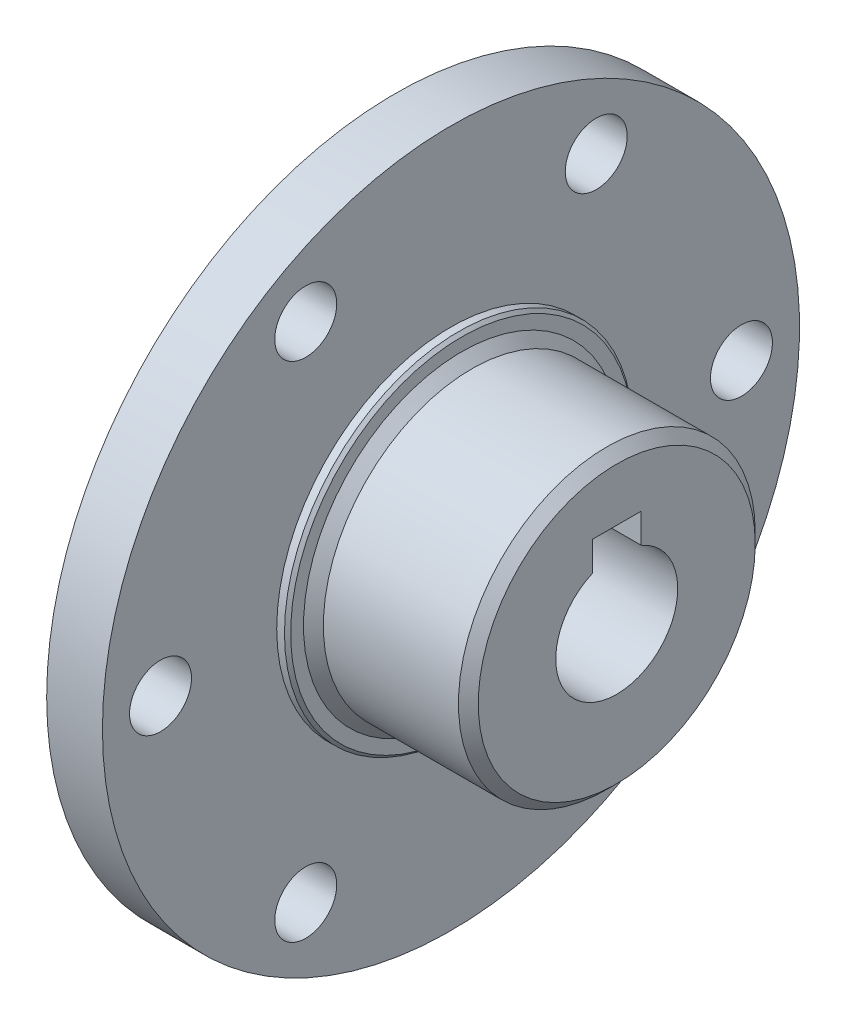
ISO-10303-21;
HEADER;
FILE_DESCRIPTION(('STEP AP214'),'2;1');
FILE_NAME('part.step','',(''),(''),'','','');
FILE_SCHEMA(('AUTOMOTIVE_DESIGN { 1 0 10303 214 1 1 1 1 }'));
ENDSEC;
DATA;
#1=APPLICATION_CONTEXT('core data for automotive mechanical design processes');
#2=APPLICATION_PROTOCOL_DEFINITION('international standard','automotive_design',2000,#1);
#3=PRODUCT_CONTEXT('',#1,'mechanical');
#4=PRODUCT('Part','Part','',(#3));
#5=PRODUCT_RELATED_PRODUCT_CATEGORY('part','',(#4));
#6=PRODUCT_DEFINITION_FORMATION('','',#4);
#7=PRODUCT_DEFINITION_CONTEXT('part definition',#1,'design');
#8=PRODUCT_DEFINITION('design','',#6,#7);
#9=PRODUCT_DEFINITION_SHAPE('','',#8);
#10=(LENGTH_UNIT() NAMED_UNIT(*) SI_UNIT(.MILLI.,.METRE.));
#11=(NAMED_UNIT(*) PLANE_ANGLE_UNIT() SI_UNIT($,.RADIAN.));
#12=(NAMED_UNIT(*) SI_UNIT($,.STERADIAN.) SOLID_ANGLE_UNIT());
#13=UNCERTAINTY_MEASURE_WITH_UNIT(LENGTH_MEASURE(1.E-05),#10,'distance_accuracy_value','');
#14=(GEOMETRIC_REPRESENTATION_CONTEXT(3) GLOBAL_UNCERTAINTY_ASSIGNED_CONTEXT((#13)) GLOBAL_UNIT_ASSIGNED_CONTEXT((#10,
#11,#12)) REPRESENTATION_CONTEXT('',''));
#15=CARTESIAN_POINT('',(0.,0.,0.));
#16=DIRECTION('',(0.,0.,1.));
#17=DIRECTION('',(1.,0.,0.));
#18=AXIS2_PLACEMENT_3D('',#15,#16,#17);
#19=CARTESIAN_POINT('',(-13.0350662460568,0.,0.));
#20=DIRECTION('',(-1.,0.,0.));
#21=DIRECTION('',(0.,0.,1.));
#22=AXIS2_PLACEMENT_3D('',#19,#20,#21);
#23=CYLINDRICAL_SURFACE('',#22,28.575);
#24=CARTESIAN_POINT('',(-13.0350662460568,0.,0.));
#25=DIRECTION('',(-1.,0.,0.));
#26=DIRECTION('',(0.,0.,1.));
#27=AXIS2_PLACEMENT_3D('',#24,#25,#26);
#28=CIRCLE('',#27,28.575);
#29=CARTESIAN_POINT('',(-13.0350662460568,0.,28.575));
#30=VERTEX_POINT('',#29);
#31=EDGE_CURVE('E115',#30,#30,#28,.T.);
#32=ORIENTED_EDGE('',*,*,#31,.T.);
#33=EDGE_LOOP('',(#32));
#34=FACE_BOUND('',#33,.T.);
#35=CARTESIAN_POINT('',(-17.6070662460568,0.,0.));
#36=DIRECTION('',(-1.,0.,0.));
#37=DIRECTION('',(0.,0.,1.));
#38=AXIS2_PLACEMENT_3D('',#35,#36,#37);
#39=CIRCLE('',#38,28.575);
#40=CARTESIAN_POINT('',(-17.6070662460568,0.,28.575));
#41=VERTEX_POINT('',#40);
#42=EDGE_CURVE('E79',#41,#41,#39,.T.);
#43=ORIENTED_EDGE('',*,*,#42,.F.);
#44=EDGE_LOOP('',(#43));
#45=FACE_BOUND('',#44,.T.);
#46=ADVANCED_FACE('F32',(#34,#45),#23,.T.);
#47=CARTESIAN_POINT('',(-13.0350662460568,28.575,0.));
#48=DIRECTION('',(1.,0.,0.));
#49=DIRECTION('',(0.,0.,-1.));
#50=AXIS2_PLACEMENT_3D('',#47,#48,#49);
#51=PLANE('',#50);
#52=CARTESIAN_POINT('',(-13.0350662460568,20.6222299276169,11.90625));
#53=DIRECTION('',(1.,0.,0.));
#54=DIRECTION('',(0.,0.,-1.));
#55=AXIS2_PLACEMENT_3D('',#52,#53,#54);
#56=CIRCLE('',#55,2.54);
#57=CARTESIAN_POINT('',(-13.0350662460568,20.6222299276169,9.36625));
#58=VERTEX_POINT('',#57);
#59=EDGE_CURVE('E200',#58,#58,#56,.T.);
#60=ORIENTED_EDGE('',*,*,#59,.F.);
#61=EDGE_LOOP('',(#60));
#62=FACE_BOUND('',#61,.T.);
#63=CARTESIAN_POINT('',(-13.0350662460568,20.6222299276169,-11.90625));
#64=DIRECTION('',(1.,0.,0.));
#65=DIRECTION('',(0.,0.,-1.));
#66=AXIS2_PLACEMENT_3D('',#63,#64,#65);
#67=CIRCLE('',#66,2.54);
#68=CARTESIAN_POINT('',(-13.0350662460568,20.6222299276169,-14.44625));
#69=VERTEX_POINT('',#68);
#70=EDGE_CURVE('E194',#69,#69,#67,.T.);
#71=ORIENTED_EDGE('',*,*,#70,.F.);
#72=EDGE_LOOP('',(#71));
#73=FACE_BOUND('',#72,.T.);
#74=CARTESIAN_POINT('',(-13.0350662460568,0.,-23.8125));
#75=DIRECTION('',(1.,0.,0.));
#76=DIRECTION('',(0.,0.,-1.));
#77=AXIS2_PLACEMENT_3D('',#74,#75,#76);
#78=CIRCLE('',#77,2.54);
#79=CARTESIAN_POINT('',(-13.0350662460568,0.,-26.3525));
#80=VERTEX_POINT('',#79);
#81=EDGE_CURVE('E188',#80,#80,#78,.T.);
#82=ORIENTED_EDGE('',*,*,#81,.F.);
#83=EDGE_LOOP('',(#82));
#84=FACE_BOUND('',#83,.T.);
#85=CARTESIAN_POINT('',(-13.0350662460568,-20.6222299276169,-11.90625));
#86=DIRECTION('',(1.,0.,0.));
#87=DIRECTION('',(0.,0.,-1.));
#88=AXIS2_PLACEMENT_3D('',#85,#86,#87);
#89=CIRCLE('',#88,2.54);
#90=CARTESIAN_POINT('',(-13.0350662460568,-20.6222299276169,-14.44625));
#91=VERTEX_POINT('',#90);
#92=EDGE_CURVE('E182',#91,#91,#89,.T.);
#93=ORIENTED_EDGE('',*,*,#92,.F.);
#94=EDGE_LOOP('',(#93));
#95=FACE_BOUND('',#94,.T.);
#96=CARTESIAN_POINT('',(-13.0350662460568,-20.622229927617,11.90625));
#97=DIRECTION('',(1.,0.,0.));
#98=DIRECTION('',(0.,0.,-1.));
#99=AXIS2_PLACEMENT_3D('',#96,#97,#98);
#100=CIRCLE('',#99,2.54);
#101=CARTESIAN_POINT('',(-13.0350662460568,-20.622229927617,9.36624999999995));
#102=VERTEX_POINT('',#101);
#103=EDGE_CURVE('E176',#102,#102,#100,.T.);
#104=ORIENTED_EDGE('',*,*,#103,.F.);
#105=EDGE_LOOP('',(#104));
#106=FACE_BOUND('',#105,.T.);
#107=CARTESIAN_POINT('',(-13.0350662460568,0.,23.8125));
#108=DIRECTION('',(1.,0.,0.));
#109=DIRECTION('',(0.,0.,-1.));
#110=AXIS2_PLACEMENT_3D('',#107,#108,#109);
#111=CIRCLE('',#110,2.54);
#112=CARTESIAN_POINT('',(-13.0350662460568,0.,21.2725));
#113=VERTEX_POINT('',#112);
#114=EDGE_CURVE('E90',#113,#113,#111,.T.);
#115=ORIENTED_EDGE('',*,*,#114,.F.);
#116=EDGE_LOOP('',(#115));
#117=FACE_BOUND('',#116,.T.);
#118=CARTESIAN_POINT('',(-13.0350662460568,0.,0.));
#119=DIRECTION('',(1.,0.,0.));
#120=DIRECTION('',(0.,0.,-1.));
#121=AXIS2_PLACEMENT_3D('',#118,#119,#120);
#122=CIRCLE('',#121,14.2875);
#123=CARTESIAN_POINT('',(-13.0350662460568,0.,-14.2875));
#124=VERTEX_POINT('',#123);
#125=EDGE_CURVE('E112',#124,#124,#122,.T.);
#126=ORIENTED_EDGE('',*,*,#125,.F.);
#127=EDGE_LOOP('',(#126));
#128=FACE_BOUND('',#127,.T.);
#129=ORIENTED_EDGE('',*,*,#31,.F.);
#130=EDGE_LOOP('',(#129));
#131=FACE_BOUND('',#130,.T.);
#132=ADVANCED_FACE('F213',(#62,#73,#84,#95,#106,#117,#128,#131),#51,.T.);
#133=CARTESIAN_POINT('',(-17.6070662460568,0.,0.));
#134=DIRECTION('',(-1.,0.,0.));
#135=DIRECTION('',(0.,0.,1.));
#136=AXIS2_PLACEMENT_3D('',#133,#134,#135);
#137=PLANE('',#136);
#138=CARTESIAN_POINT('',(-17.6070662460568,20.6222299276169,11.90625));
#139=DIRECTION('',(-1.,0.,0.));
#140=DIRECTION('',(0.,0.,1.));
#141=AXIS2_PLACEMENT_3D('',#138,#139,#140);
#142=CIRCLE('',#141,2.54);
#143=CARTESIAN_POINT('',(-17.6070662460568,20.6222299276169,14.44625));
#144=VERTEX_POINT('',#143);
#145=EDGE_CURVE('E203',#144,#144,#142,.T.);
#146=ORIENTED_EDGE('',*,*,#145,.F.);
#147=EDGE_LOOP('',(#146));
#148=FACE_BOUND('',#147,.T.);
#149=CARTESIAN_POINT('',(-17.6070662460568,20.6222299276169,-11.90625));
#150=DIRECTION('',(-1.,0.,0.));
#151=DIRECTION('',(0.,0.,1.));
#152=AXIS2_PLACEMENT_3D('',#149,#150,#151);
#153=CIRCLE('',#152,2.54);
#154=CARTESIAN_POINT('',(-17.6070662460568,20.6222299276169,-9.36624999999998));
#155=VERTEX_POINT('',#154);
#156=EDGE_CURVE('E197',#155,#155,#153,.T.);
#157=ORIENTED_EDGE('',*,*,#156,.F.);
#158=EDGE_LOOP('',(#157));
#159=FACE_BOUND('',#158,.T.);
#160=CARTESIAN_POINT('',(-17.6070662460568,0.,-23.8125));
#161=DIRECTION('',(-1.,0.,0.));
#162=DIRECTION('',(0.,0.,1.));
#163=AXIS2_PLACEMENT_3D('',#160,#161,#162);
#164=CIRCLE('',#163,2.54);
#165=CARTESIAN_POINT('',(-17.6070662460568,0.,-21.2725));
#166=VERTEX_POINT('',#165);
#167=EDGE_CURVE('E191',#166,#166,#164,.T.);
#168=ORIENTED_EDGE('',*,*,#167,.F.);
#169=EDGE_LOOP('',(#168));
#170=FACE_BOUND('',#169,.T.);
#171=CARTESIAN_POINT('',(-17.6070662460568,-20.6222299276169,-11.90625));
#172=DIRECTION('',(-1.,0.,0.));
#173=DIRECTION('',(0.,0.,1.));
#174=AXIS2_PLACEMENT_3D('',#171,#172,#173);
#175=CIRCLE('',#174,2.54);
#176=CARTESIAN_POINT('',(-17.6070662460568,-20.6222299276169,-9.36625000000004));
#177=VERTEX_POINT('',#176);
#178=EDGE_CURVE('E185',#177,#177,#175,.T.);
#179=ORIENTED_EDGE('',*,*,#178,.F.);
#180=EDGE_LOOP('',(#179));
#181=FACE_BOUND('',#180,.T.);
#182=CARTESIAN_POINT('',(-17.6070662460568,-20.622229927617,11.90625));
#183=DIRECTION('',(-1.,0.,0.));
#184=DIRECTION('',(0.,0.,1.));
#185=AXIS2_PLACEMENT_3D('',#182,#183,#184);
#186=CIRCLE('',#185,2.54);
#187=CARTESIAN_POINT('',(-17.6070662460568,-20.622229927617,14.44625));
#188=VERTEX_POINT('',#187);
#189=EDGE_CURVE('E179',#188,#188,#186,.T.);
#190=ORIENTED_EDGE('',*,*,#189,.F.);
#191=EDGE_LOOP('',(#190));
#192=FACE_BOUND('',#191,.T.);
#193=CARTESIAN_POINT('',(-17.6070662460568,0.,23.8125));
#194=DIRECTION('',(-1.,0.,0.));
#195=DIRECTION('',(0.,0.,1.));
#196=AXIS2_PLACEMENT_3D('',#193,#194,#195);
#197=CIRCLE('',#196,2.54);
#198=CARTESIAN_POINT('',(-17.6070662460568,0.,26.3525));
#199=VERTEX_POINT('',#198);
#200=EDGE_CURVE('E122',#199,#199,#197,.T.);
#201=ORIENTED_EDGE('',*,*,#200,.F.);
#202=EDGE_LOOP('',(#201));
#203=FACE_BOUND('',#202,.T.);
#204=CARTESIAN_POINT('',(-17.6070662460568,0.,0.));
#205=DIRECTION('',(-1.,0.,0.));
#206=DIRECTION('',(0.,0.,1.));
#207=AXIS2_PLACEMENT_3D('',#204,#205,#206);
#208=CIRCLE('',#207,14.2875);
#209=CARTESIAN_POINT('',(-17.6070662460568,0.,14.2875));
#210=VERTEX_POINT('',#209);
#211=EDGE_CURVE('E108',#210,#210,#208,.T.);
#212=ORIENTED_EDGE('',*,*,#211,.F.);
#213=EDGE_LOOP('',(#212));
#214=FACE_BOUND('',#213,.T.);
#215=ORIENTED_EDGE('',*,*,#42,.T.);
#216=EDGE_LOOP('',(#215));
#217=FACE_BOUND('',#216,.T.);
#218=ADVANCED_FACE('F209',(#148,#159,#170,#181,#192,#203,#214,#217),#137,.T.);
#219=CARTESIAN_POINT('',(-12.1460662460568,0.,0.));
#220=DIRECTION('',(-1.,0.,0.));
#221=DIRECTION('',(0.,0.,1.));
#222=AXIS2_PLACEMENT_3D('',#219,#220,#221);
#223=CYLINDRICAL_SURFACE('',#222,14.2875);
#224=CARTESIAN_POINT('',(-12.4000662460568,0.,0.));
#225=DIRECTION('',(1.,0.,0.));
#226=DIRECTION('',(0.,0.,-1.));
#227=AXIS2_PLACEMENT_3D('',#224,#225,#226);
#228=CIRCLE('',#227,14.2875);
#229=CARTESIAN_POINT('',(-12.4000662460568,0.,-14.2875));
#230=VERTEX_POINT('',#229);
#231=EDGE_CURVE('E125',#230,#230,#228,.F.);
#232=ORIENTED_EDGE('',*,*,#231,.T.);
#233=EDGE_LOOP('',(#232));
#234=FACE_BOUND('',#233,.T.);
#235=ORIENTED_EDGE('',*,*,#125,.T.);
#236=EDGE_LOOP('',(#235));
#237=FACE_BOUND('',#236,.T.);
#238=ADVANCED_FACE('F212',(#234,#237),#223,.T.);
#239=CARTESIAN_POINT('',(-12.1460662460568,0.,0.));
#240=DIRECTION('',(1.,0.,0.));
#241=DIRECTION('',(0.,0.,-1.));
#242=AXIS2_PLACEMENT_3D('',#239,#240,#241);
#243=PLANE('',#242);
#244=CARTESIAN_POINT('',(-12.1460662460568,0.,0.));
#245=DIRECTION('',(1.,0.,0.));
#246=DIRECTION('',(0.,0.,-1.));
#247=AXIS2_PLACEMENT_3D('',#244,#245,#246);
#248=CIRCLE('',#247,12.9794);
#249=CARTESIAN_POINT('',(-12.1460662460568,0.,-12.9794));
#250=VERTEX_POINT('',#249);
#251=EDGE_CURVE('E40',#250,#250,#248,.F.);
#252=ORIENTED_EDGE('',*,*,#251,.T.);
#253=EDGE_LOOP('',(#252));
#254=FACE_BOUND('',#253,.T.);
#255=CARTESIAN_POINT('',(-12.1460662460568,0.,0.));
#256=DIRECTION('',(1.,0.,0.));
#257=DIRECTION('',(0.,0.,-1.));
#258=AXIS2_PLACEMENT_3D('',#255,#256,#257);
#259=CIRCLE('',#258,14.0335);
#260=CARTESIAN_POINT('',(-12.1460662460568,0.,-14.0335));
#261=VERTEX_POINT('',#260);
#262=EDGE_CURVE('E111',#261,#261,#259,.T.);
#263=ORIENTED_EDGE('',*,*,#262,.T.);
#264=EDGE_LOOP('',(#263));
#265=FACE_BOUND('',#264,.T.);
#266=ADVANCED_FACE('F142',(#254,#265),#243,.T.);
#267=CARTESIAN_POINT('',(0.553933753943227,0.,0.));
#268=DIRECTION('',(-1.,0.,0.));
#269=DIRECTION('',(0.,0.,1.));
#270=AXIS2_PLACEMENT_3D('',#267,#268,#269);
#271=CYLINDRICAL_SURFACE('',#270,12.1666);
#272=CARTESIAN_POINT('',(-11.3332662460568,0.,0.));
#273=DIRECTION('',(1.,0.,0.));
#274=DIRECTION('',(0.,0.,-1.));
#275=AXIS2_PLACEMENT_3D('',#272,#273,#274);
#276=CIRCLE('',#275,12.1666);
#277=CARTESIAN_POINT('',(-11.3332662460568,0.,-12.1666));
#278=VERTEX_POINT('',#277);
#279=EDGE_CURVE('E137',#278,#278,#276,.T.);
#280=ORIENTED_EDGE('',*,*,#279,.T.);
#281=EDGE_LOOP('',(#280));
#282=FACE_BOUND('',#281,.T.);
#283=CARTESIAN_POINT('',(-0.258866246056769,0.,0.));
#284=DIRECTION('',(1.,0.,0.));
#285=DIRECTION('',(0.,0.,-1.));
#286=AXIS2_PLACEMENT_3D('',#283,#284,#285);
#287=CIRCLE('',#286,12.1666);
#288=CARTESIAN_POINT('',(-0.258866246056769,0.,-12.1666));
#289=VERTEX_POINT('',#288);
#290=EDGE_CURVE('E134',#289,#289,#287,.F.);
#291=ORIENTED_EDGE('',*,*,#290,.T.);
#292=EDGE_LOOP('',(#291));
#293=FACE_BOUND('',#292,.T.);
#294=ADVANCED_FACE('F151',(#282,#293),#271,.T.);
#295=CARTESIAN_POINT('',(0.553933753943227,0.,0.));
#296=DIRECTION('',(1.,0.,0.));
#297=DIRECTION('',(0.,0.,-1.));
#298=AXIS2_PLACEMENT_3D('',#295,#296,#297);
#299=PLANE('',#298);
#300=CARTESIAN_POINT('',(0.553933753943227,0.,0.));
#301=DIRECTION('',(1.,0.,0.));
#302=DIRECTION('',(0.,0.,-1.));
#303=AXIS2_PLACEMENT_3D('',#300,#301,#302);
#304=CIRCLE('',#303,11.3538);
#305=CARTESIAN_POINT('',(0.553933753943227,0.,-11.3538));
#306=VERTEX_POINT('',#305);
#307=EDGE_CURVE('E11',#306,#306,#304,.T.);
#308=ORIENTED_EDGE('',*,*,#307,.T.);
#309=EDGE_LOOP('',(#308));
#310=FACE_BOUND('',#309,.T.);
#311=CARTESIAN_POINT('',(0.553933753943227,0.,0.));
#312=DIRECTION('',(-1.,0.,0.));
#313=DIRECTION('',(0.,0.,1.));
#314=AXIS2_PLACEMENT_3D('',#311,#312,#313);
#315=CIRCLE('',#314,5.);
#316=CARTESIAN_POINT('',(0.553933753943227,4.58257569495584,-2.));
#317=VERTEX_POINT('',#316);
#318=CARTESIAN_POINT('',(0.553933753943227,4.58257569495584,2.));
#319=VERTEX_POINT('',#318);
#320=EDGE_CURVE('E74',#317,#319,#315,.T.);
#321=ORIENTED_EDGE('',*,*,#320,.T.);
#322=DIRECTION('',(0.,1.,0.));
#323=VECTOR('',#322,1.);
#324=CARTESIAN_POINT('',(0.553933753943227,4.58257569495584,2.));
#325=LINE('',#324,#323);
#326=CARTESIAN_POINT('',(0.553933753943227,7.,2.));
#327=VERTEX_POINT('',#326);
#328=EDGE_CURVE('E94',#319,#327,#325,.T.);
#329=ORIENTED_EDGE('',*,*,#328,.T.);
#330=DIRECTION('',(0.,0.,-1.));
#331=VECTOR('',#330,1.);
#332=CARTESIAN_POINT('',(0.553933753943227,7.,2.));
#333=LINE('',#332,#331);
#334=CARTESIAN_POINT('',(0.553933753943227,7.,-2.));
#335=VERTEX_POINT('',#334);
#336=EDGE_CURVE('E47',#327,#335,#333,.T.);
#337=ORIENTED_EDGE('',*,*,#336,.T.);
#338=DIRECTION('',(0.,-1.,0.));
#339=VECTOR('',#338,1.);
#340=CARTESIAN_POINT('',(0.553933753943227,7.,-2.));
#341=LINE('',#340,#339);
#342=EDGE_CURVE('E107',#335,#317,#341,.T.);
#343=ORIENTED_EDGE('',*,*,#342,.T.);
#344=EDGE_LOOP('',(#321,#329,#337,#343));
#345=FACE_BOUND('',#344,.T.);
#346=ADVANCED_FACE('F154',(#310,#345),#299,.T.);
#347=CARTESIAN_POINT('',(-18.4960662460568,0.,0.));
#348=DIRECTION('',(1.,0.,0.));
#349=DIRECTION('',(0.,0.,-1.));
#350=AXIS2_PLACEMENT_3D('',#347,#348,#349);
#351=CYLINDRICAL_SURFACE('',#350,14.2875);
#352=CARTESIAN_POINT('',(-18.2420662460568,0.,0.));
#353=DIRECTION('',(-1.,0.,0.));
#354=DIRECTION('',(0.,0.,1.));
#355=AXIS2_PLACEMENT_3D('',#352,#353,#354);
#356=CIRCLE('',#355,14.2875);
#357=CARTESIAN_POINT('',(-18.2420662460568,0.,14.2875));
#358=VERTEX_POINT('',#357);
#359=EDGE_CURVE('E131',#358,#358,#356,.F.);
#360=ORIENTED_EDGE('',*,*,#359,.T.);
#361=EDGE_LOOP('',(#360));
#362=FACE_BOUND('',#361,.T.);
#363=ORIENTED_EDGE('',*,*,#211,.T.);
#364=EDGE_LOOP('',(#363));
#365=FACE_BOUND('',#364,.T.);
#366=ADVANCED_FACE('F164',(#362,#365),#351,.T.);
#367=CARTESIAN_POINT('',(-18.4960662460568,0.,0.));
#368=DIRECTION('',(-1.,0.,0.));
#369=DIRECTION('',(0.,0.,1.));
#370=AXIS2_PLACEMENT_3D('',#367,#368,#369);
#371=PLANE('',#370);
#372=CARTESIAN_POINT('',(-18.4960662460568,0.,0.));
#373=DIRECTION('',(-1.,0.,0.));
#374=DIRECTION('',(0.,0.,1.));
#375=AXIS2_PLACEMENT_3D('',#372,#373,#374);
#376=CIRCLE('',#375,14.0335);
#377=CARTESIAN_POINT('',(-18.4960662460568,0.,14.0335));
#378=VERTEX_POINT('',#377);
#379=EDGE_CURVE('E128',#378,#378,#376,.T.);
#380=ORIENTED_EDGE('',*,*,#379,.T.);
#381=EDGE_LOOP('',(#380));
#382=FACE_BOUND('',#381,.T.);
#383=CARTESIAN_POINT('',(-18.4960662460568,0.,0.));
#384=DIRECTION('',(-1.,0.,0.));
#385=DIRECTION('',(0.,0.,1.));
#386=AXIS2_PLACEMENT_3D('',#383,#384,#385);
#387=CIRCLE('',#386,5.);
#388=CARTESIAN_POINT('',(-18.4960662460568,4.58257569495584,-2.));
#389=VERTEX_POINT('',#388);
#390=CARTESIAN_POINT('',(-18.4960662460568,4.58257569495584,2.));
#391=VERTEX_POINT('',#390);
#392=EDGE_CURVE('E55',#389,#391,#387,.T.);
#393=ORIENTED_EDGE('',*,*,#392,.F.);
#394=DIRECTION('',(0.,-1.,0.));
#395=VECTOR('',#394,1.);
#396=CARTESIAN_POINT('',(-18.4960662460568,7.,-2.));
#397=LINE('',#396,#395);
#398=CARTESIAN_POINT('',(-18.4960662460568,7.,-2.));
#399=VERTEX_POINT('',#398);
#400=EDGE_CURVE('E87',#399,#389,#397,.T.);
#401=ORIENTED_EDGE('',*,*,#400,.F.);
#402=DIRECTION('',(0.,0.,-1.));
#403=VECTOR('',#402,1.);
#404=CARTESIAN_POINT('',(-18.4960662460568,7.,2.));
#405=LINE('',#404,#403);
#406=CARTESIAN_POINT('',(-18.4960662460568,7.,2.));
#407=VERTEX_POINT('',#406);
#408=EDGE_CURVE('E95',#407,#399,#405,.T.);
#409=ORIENTED_EDGE('',*,*,#408,.F.);
#410=DIRECTION('',(0.,1.,0.));
#411=VECTOR('',#410,1.);
#412=CARTESIAN_POINT('',(-18.4960662460568,4.58257569495584,2.));
#413=LINE('',#412,#411);
#414=EDGE_CURVE('E89',#391,#407,#413,.T.);
#415=ORIENTED_EDGE('',*,*,#414,.F.);
#416=EDGE_LOOP('',(#393,#401,#409,#415));
#417=FACE_BOUND('',#416,.T.);
#418=ADVANCED_FACE('F85',(#382,#417),#371,.T.);
#419=CARTESIAN_POINT('',(0.553933753943227,7.,-2.));
#420=DIRECTION('',(0.,0.,-1.));
#421=DIRECTION('',(0.,1.,0.));
#422=AXIS2_PLACEMENT_3D('',#419,#420,#421);
#423=PLANE('',#422);
#424=ORIENTED_EDGE('',*,*,#400,.T.);
#425=DIRECTION('',(-1.,0.,0.));
#426=VECTOR('',#425,1.);
#427=CARTESIAN_POINT('',(0.553933753943227,4.58257569495584,-2.));
#428=LINE('',#427,#426);
#429=EDGE_CURVE('E71',#317,#389,#428,.T.);
#430=ORIENTED_EDGE('',*,*,#429,.F.);
#431=ORIENTED_EDGE('',*,*,#342,.F.);
#432=DIRECTION('',(-1.,0.,0.));
#433=VECTOR('',#432,1.);
#434=CARTESIAN_POINT('',(0.553933753943227,7.,-2.));
#435=LINE('',#434,#433);
#436=EDGE_CURVE('E80',#335,#399,#435,.T.);
#437=ORIENTED_EDGE('',*,*,#436,.T.);
#438=EDGE_LOOP('',(#424,#430,#431,#437));
#439=FACE_BOUND('',#438,.T.);
#440=ADVANCED_FACE('F92',(#439),#423,.F.);
#441=CARTESIAN_POINT('',(0.553933753943227,7.,2.));
#442=DIRECTION('',(0.,1.,0.));
#443=DIRECTION('',(0.,0.,1.));
#444=AXIS2_PLACEMENT_3D('',#441,#442,#443);
#445=PLANE('',#444);
#446=ORIENTED_EDGE('',*,*,#408,.T.);
#447=ORIENTED_EDGE('',*,*,#436,.F.);
#448=ORIENTED_EDGE('',*,*,#336,.F.);
#449=DIRECTION('',(-1.,0.,0.));
#450=VECTOR('',#449,1.);
#451=CARTESIAN_POINT('',(0.553933753943227,7.,2.));
#452=LINE('',#451,#450);
#453=EDGE_CURVE('E103',#327,#407,#452,.T.);
#454=ORIENTED_EDGE('',*,*,#453,.T.);
#455=EDGE_LOOP('',(#446,#447,#448,#454));
#456=FACE_BOUND('',#455,.T.);
#457=ADVANCED_FACE('F170',(#456),#445,.F.);
#458=CARTESIAN_POINT('',(0.553933753943227,4.58257569495584,2.));
#459=DIRECTION('',(0.,0.,1.));
#460=DIRECTION('',(0.,-1.,0.));
#461=AXIS2_PLACEMENT_3D('',#458,#459,#460);
#462=PLANE('',#461);
#463=ORIENTED_EDGE('',*,*,#414,.T.);
#464=ORIENTED_EDGE('',*,*,#453,.F.);
#465=ORIENTED_EDGE('',*,*,#328,.F.);
#466=DIRECTION('',(-1.,0.,0.));
#467=VECTOR('',#466,1.);
#468=CARTESIAN_POINT('',(0.553933753943227,4.58257569495584,2.));
#469=LINE('',#468,#467);
#470=EDGE_CURVE('E105',#319,#391,#469,.T.);
#471=ORIENTED_EDGE('',*,*,#470,.T.);
#472=EDGE_LOOP('',(#463,#464,#465,#471));
#473=FACE_BOUND('',#472,.T.);
#474=ADVANCED_FACE('F169',(#473),#462,.F.);
#475=CARTESIAN_POINT('',(0.553933753943227,0.,0.));
#476=DIRECTION('',(-1.,0.,0.));
#477=DIRECTION('',(0.,0.,1.));
#478=AXIS2_PLACEMENT_3D('',#475,#476,#477);
#479=CYLINDRICAL_SURFACE('',#478,5.);
#480=ORIENTED_EDGE('',*,*,#392,.T.);
#481=ORIENTED_EDGE('',*,*,#470,.F.);
#482=ORIENTED_EDGE('',*,*,#320,.F.);
#483=ORIENTED_EDGE('',*,*,#429,.T.);
#484=EDGE_LOOP('',(#480,#481,#482,#483));
#485=FACE_BOUND('',#484,.T.);
#486=ADVANCED_FACE('F72',(#485),#479,.F.);
#487=CARTESIAN_POINT('',(-17.6070662460568,0.,23.8125));
#488=DIRECTION('',(-1.,0.,0.));
#489=DIRECTION('',(0.,0.,1.));
#490=AXIS2_PLACEMENT_3D('',#487,#488,#489);
#491=CYLINDRICAL_SURFACE('',#490,2.54);
#492=ORIENTED_EDGE('',*,*,#114,.T.);
#493=EDGE_LOOP('',(#492));
#494=FACE_BOUND('',#493,.T.);
#495=ORIENTED_EDGE('',*,*,#200,.T.);
#496=EDGE_LOOP('',(#495));
#497=FACE_BOUND('',#496,.T.);
#498=ADVANCED_FACE('F361',(#494,#497),#491,.F.);
#499=CARTESIAN_POINT('',(-17.6070662460568,-20.622229927617,11.90625));
#500=DIRECTION('',(-1.,0.,0.));
#501=DIRECTION('',(0.,0.,1.));
#502=AXIS2_PLACEMENT_3D('',#499,#500,#501);
#503=CYLINDRICAL_SURFACE('',#502,2.54);
#504=ORIENTED_EDGE('',*,*,#103,.T.);
#505=EDGE_LOOP('',(#504));
#506=FACE_BOUND('',#505,.T.);
#507=ORIENTED_EDGE('',*,*,#189,.T.);
#508=EDGE_LOOP('',(#507));
#509=FACE_BOUND('',#508,.T.);
#510=ADVANCED_FACE('F353',(#506,#509),#503,.F.);
#511=CARTESIAN_POINT('',(-17.6070662460568,-20.6222299276169,-11.90625));
#512=DIRECTION('',(-1.,0.,0.));
#513=DIRECTION('',(0.,0.,1.));
#514=AXIS2_PLACEMENT_3D('',#511,#512,#513);
#515=CYLINDRICAL_SURFACE('',#514,2.54);
#516=ORIENTED_EDGE('',*,*,#92,.T.);
#517=EDGE_LOOP('',(#516));
#518=FACE_BOUND('',#517,.T.);
#519=ORIENTED_EDGE('',*,*,#178,.T.);
#520=EDGE_LOOP('',(#519));
#521=FACE_BOUND('',#520,.T.);
#522=ADVANCED_FACE('F345',(#518,#521),#515,.F.);
#523=CARTESIAN_POINT('',(-17.6070662460568,0.,-23.8125));
#524=DIRECTION('',(-1.,0.,0.));
#525=DIRECTION('',(0.,0.,1.));
#526=AXIS2_PLACEMENT_3D('',#523,#524,#525);
#527=CYLINDRICAL_SURFACE('',#526,2.54);
#528=ORIENTED_EDGE('',*,*,#81,.T.);
#529=EDGE_LOOP('',(#528));
#530=FACE_BOUND('',#529,.T.);
#531=ORIENTED_EDGE('',*,*,#167,.T.);
#532=EDGE_LOOP('',(#531));
#533=FACE_BOUND('',#532,.T.);
#534=ADVANCED_FACE('F337',(#530,#533),#527,.F.);
#535=CARTESIAN_POINT('',(-17.6070662460568,20.6222299276169,-11.90625));
#536=DIRECTION('',(-1.,0.,0.));
#537=DIRECTION('',(0.,0.,1.));
#538=AXIS2_PLACEMENT_3D('',#535,#536,#537);
#539=CYLINDRICAL_SURFACE('',#538,2.54);
#540=ORIENTED_EDGE('',*,*,#70,.T.);
#541=EDGE_LOOP('',(#540));
#542=FACE_BOUND('',#541,.T.);
#543=ORIENTED_EDGE('',*,*,#156,.T.);
#544=EDGE_LOOP('',(#543));
#545=FACE_BOUND('',#544,.T.);
#546=ADVANCED_FACE('F330',(#542,#545),#539,.F.);
#547=CARTESIAN_POINT('',(-17.6070662460568,20.6222299276169,11.90625));
#548=DIRECTION('',(-1.,0.,0.));
#549=DIRECTION('',(0.,0.,1.));
#550=AXIS2_PLACEMENT_3D('',#547,#548,#549);
#551=CYLINDRICAL_SURFACE('',#550,2.54);
#552=ORIENTED_EDGE('',*,*,#59,.T.);
#553=EDGE_LOOP('',(#552));
#554=FACE_BOUND('',#553,.T.);
#555=ORIENTED_EDGE('',*,*,#145,.T.);
#556=EDGE_LOOP('',(#555));
#557=FACE_BOUND('',#556,.T.);
#558=ADVANCED_FACE('F207',(#554,#557),#551,.F.);
#559=CARTESIAN_POINT('',(-12.1460662460568,0.,0.));
#560=DIRECTION('',(-1.,0.,0.));
#561=DIRECTION('',(0.,0.,1.));
#562=AXIS2_PLACEMENT_3D('',#559,#560,#561);
#563=CONICAL_SURFACE('',#562,14.0335,0.785398163397452);
#564=ORIENTED_EDGE('',*,*,#231,.F.);
#565=EDGE_LOOP('',(#564));
#566=FACE_BOUND('',#565,.T.);
#567=ORIENTED_EDGE('',*,*,#262,.F.);
#568=EDGE_LOOP('',(#567));
#569=FACE_BOUND('',#568,.T.);
#570=ADVANCED_FACE('F238',(#566,#569),#563,.T.);
#571=CARTESIAN_POINT('',(-18.4960662460568,0.,0.));
#572=DIRECTION('',(1.,0.,0.));
#573=DIRECTION('',(0.,0.,-1.));
#574=AXIS2_PLACEMENT_3D('',#571,#572,#573);
#575=CONICAL_SURFACE('',#574,14.0335,0.785398163397448);
#576=ORIENTED_EDGE('',*,*,#359,.F.);
#577=EDGE_LOOP('',(#576));
#578=FACE_BOUND('',#577,.T.);
#579=ORIENTED_EDGE('',*,*,#379,.F.);
#580=EDGE_LOOP('',(#579));
#581=FACE_BOUND('',#580,.T.);
#582=ADVANCED_FACE('F148',(#578,#581),#575,.T.);
#583=CARTESIAN_POINT('',(-11.3332662460568,0.,0.));
#584=DIRECTION('',(-1.,0.,0.));
#585=DIRECTION('',(0.,0.,1.));
#586=AXIS2_PLACEMENT_3D('',#583,#584,#585);
#587=CONICAL_SURFACE('',#586,12.1666,0.785398163397437);
#588=ORIENTED_EDGE('',*,*,#251,.F.);
#589=EDGE_LOOP('',(#588));
#590=FACE_BOUND('',#589,.T.);
#591=ORIENTED_EDGE('',*,*,#279,.F.);
#592=EDGE_LOOP('',(#591));
#593=FACE_BOUND('',#592,.T.);
#594=ADVANCED_FACE('F145',(#590,#593),#587,.T.);
#595=CARTESIAN_POINT('',(0.553933753943227,0.,0.));
#596=DIRECTION('',(-1.,0.,0.));
#597=DIRECTION('',(0.,0.,1.));
#598=AXIS2_PLACEMENT_3D('',#595,#596,#597);
#599=CONICAL_SURFACE('',#598,11.3538,0.785398163397446);
#600=ORIENTED_EDGE('',*,*,#290,.F.);
#601=EDGE_LOOP('',(#600));
#602=FACE_BOUND('',#601,.T.);
#603=ORIENTED_EDGE('',*,*,#307,.F.);
#604=EDGE_LOOP('',(#603));
#605=FACE_BOUND('',#604,.T.);
#606=ADVANCED_FACE('F34',(#602,#605),#599,.T.);
#607=CLOSED_SHELL('',(#46,#132,#218,#238,#266,#294,#346,#366,#418,#440,#457,#474,#486,#498,#510,
#522,#534,#546,#558,#570,#582,#594,#606));
#608=MANIFOLD_SOLID_BREP('B2',#607);
#609=ADVANCED_BREP_SHAPE_REPRESENTATION('',(#18,#608),#14);
#610=SHAPE_DEFINITION_REPRESENTATION(#9,#609);
ENDSEC;
END-ISO-10303-21;
